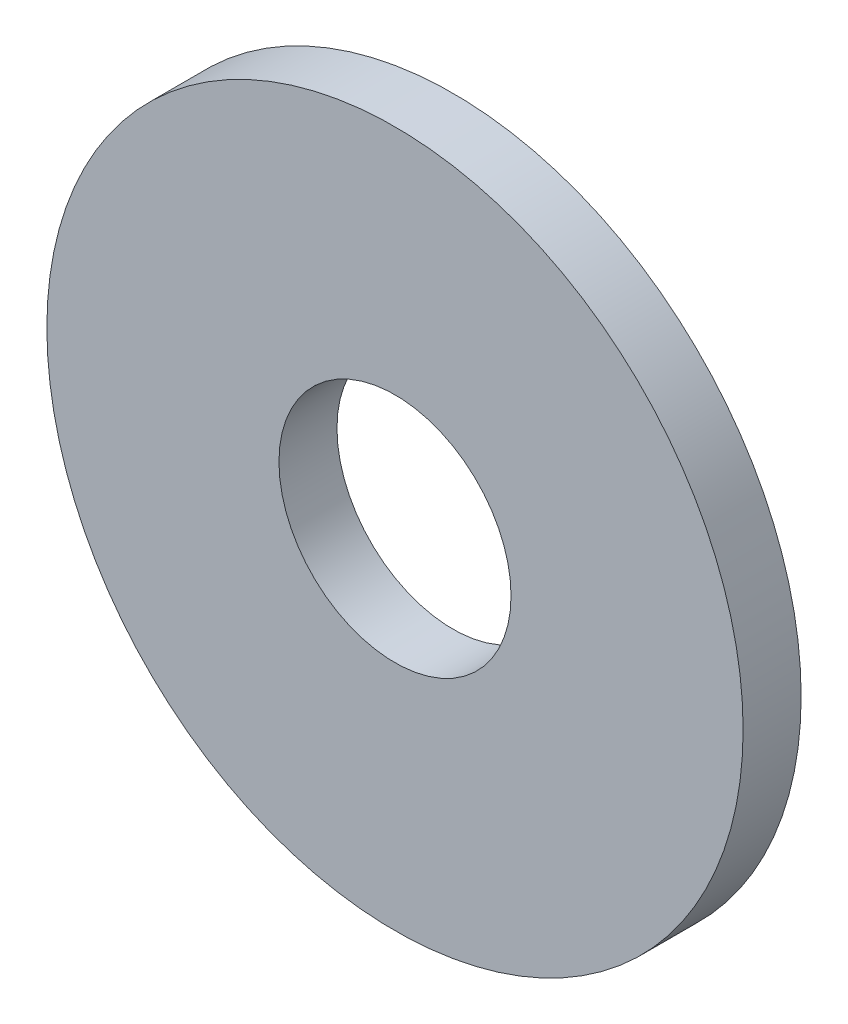
ISO-10303-21;
HEADER;
FILE_DESCRIPTION(('STEP AP214'),'2;1');
FILE_NAME('part.step','',(''),(''),'','','');
FILE_SCHEMA(('AUTOMOTIVE_DESIGN { 1 0 10303 214 1 1 1 1 }'));
ENDSEC;
DATA;
#1=APPLICATION_CONTEXT('core data for automotive mechanical design processes');
#2=APPLICATION_PROTOCOL_DEFINITION('international standard','automotive_design',2000,#1);
#3=PRODUCT_CONTEXT('',#1,'mechanical');
#4=PRODUCT('Part','Part','',(#3));
#5=PRODUCT_RELATED_PRODUCT_CATEGORY('part','',(#4));
#6=PRODUCT_DEFINITION_FORMATION('','',#4);
#7=PRODUCT_DEFINITION_CONTEXT('part definition',#1,'design');
#8=PRODUCT_DEFINITION('design','',#6,#7);
#9=PRODUCT_DEFINITION_SHAPE('','',#8);
#10=(LENGTH_UNIT() NAMED_UNIT(*) SI_UNIT(.MILLI.,.METRE.));
#11=(NAMED_UNIT(*) PLANE_ANGLE_UNIT() SI_UNIT($,.RADIAN.));
#12=(NAMED_UNIT(*) SI_UNIT($,.STERADIAN.) SOLID_ANGLE_UNIT());
#13=UNCERTAINTY_MEASURE_WITH_UNIT(LENGTH_MEASURE(1.E-05),#10,'distance_accuracy_value','');
#14=(GEOMETRIC_REPRESENTATION_CONTEXT(3) GLOBAL_UNCERTAINTY_ASSIGNED_CONTEXT((#13)) GLOBAL_UNIT_ASSIGNED_CONTEXT((#10,
#11,#12)) REPRESENTATION_CONTEXT('',''));
#15=CARTESIAN_POINT('',(0.,0.,0.));
#16=DIRECTION('',(0.,0.,1.));
#17=DIRECTION('',(1.,0.,0.));
#18=AXIS2_PLACEMENT_3D('',#15,#16,#17);
#19=CARTESIAN_POINT('',(0.,0.,1.));
#20=DIRECTION('',(0.,0.,1.));
#21=DIRECTION('',(1.,0.,0.));
#22=AXIS2_PLACEMENT_3D('',#19,#20,#21);
#23=PLANE('',#22);
#24=CARTESIAN_POINT('',(0.,0.,1.));
#25=DIRECTION('',(0.,0.,1.));
#26=DIRECTION('',(1.,0.,0.));
#27=AXIS2_PLACEMENT_3D('',#24,#25,#26);
#28=CIRCLE('',#27,6.);
#29=CARTESIAN_POINT('',(6.,0.,1.));
#30=VERTEX_POINT('',#29);
#31=EDGE_CURVE('E10',#30,#30,#28,.T.);
#32=ORIENTED_EDGE('',*,*,#31,.T.);
#33=EDGE_LOOP('',(#32));
#34=FACE_BOUND('',#33,.T.);
#35=CARTESIAN_POINT('',(0.,0.,1.));
#36=DIRECTION('',(0.,0.,1.));
#37=DIRECTION('',(1.,0.,0.));
#38=AXIS2_PLACEMENT_3D('',#35,#36,#37);
#39=CIRCLE('',#38,2.);
#40=CARTESIAN_POINT('',(2.,0.,1.));
#41=VERTEX_POINT('',#40);
#42=EDGE_CURVE('E46',#41,#41,#39,.T.);
#43=ORIENTED_EDGE('',*,*,#42,.F.);
#44=EDGE_LOOP('',(#43));
#45=FACE_BOUND('',#44,.T.);
#46=ADVANCED_FACE('F35',(#34,#45),#23,.T.);
#47=CARTESIAN_POINT('',(0.,0.,0.));
#48=DIRECTION('',(0.,0.,1.));
#49=DIRECTION('',(1.,0.,0.));
#50=AXIS2_PLACEMENT_3D('',#47,#48,#49);
#51=PLANE('',#50);
#52=CARTESIAN_POINT('',(0.,0.,0.));
#53=DIRECTION('',(0.,0.,1.));
#54=DIRECTION('',(1.,0.,0.));
#55=AXIS2_PLACEMENT_3D('',#52,#53,#54);
#56=CIRCLE('',#55,6.);
#57=CARTESIAN_POINT('',(6.,0.,0.));
#58=VERTEX_POINT('',#57);
#59=EDGE_CURVE('E39',#58,#58,#56,.T.);
#60=ORIENTED_EDGE('',*,*,#59,.F.);
#61=EDGE_LOOP('',(#60));
#62=FACE_BOUND('',#61,.T.);
#63=CARTESIAN_POINT('',(0.,0.,0.));
#64=DIRECTION('',(0.,0.,1.));
#65=DIRECTION('',(1.,0.,0.));
#66=AXIS2_PLACEMENT_3D('',#63,#64,#65);
#67=CIRCLE('',#66,2.);
#68=CARTESIAN_POINT('',(2.,0.,0.));
#69=VERTEX_POINT('',#68);
#70=EDGE_CURVE('E48',#69,#69,#67,.T.);
#71=ORIENTED_EDGE('',*,*,#70,.T.);
#72=EDGE_LOOP('',(#71));
#73=FACE_BOUND('',#72,.T.);
#74=ADVANCED_FACE('F58',(#62,#73),#51,.F.);
#75=CARTESIAN_POINT('',(0.,0.,1.));
#76=DIRECTION('',(0.,0.,-1.));
#77=DIRECTION('',(-1.,0.,0.));
#78=AXIS2_PLACEMENT_3D('',#75,#76,#77);
#79=CYLINDRICAL_SURFACE('',#78,6.);
#80=ORIENTED_EDGE('',*,*,#31,.F.);
#81=EDGE_LOOP('',(#80));
#82=FACE_BOUND('',#81,.T.);
#83=ORIENTED_EDGE('',*,*,#59,.T.);
#84=EDGE_LOOP('',(#83));
#85=FACE_BOUND('',#84,.T.);
#86=ADVANCED_FACE('F37',(#82,#85),#79,.T.);
#87=CARTESIAN_POINT('',(0.,0.,1.));
#88=DIRECTION('',(0.,0.,-1.));
#89=DIRECTION('',(-1.,0.,0.));
#90=AXIS2_PLACEMENT_3D('',#87,#88,#89);
#91=CYLINDRICAL_SURFACE('',#90,2.);
#92=ORIENTED_EDGE('',*,*,#42,.T.);
#93=EDGE_LOOP('',(#92));
#94=FACE_BOUND('',#93,.T.);
#95=ORIENTED_EDGE('',*,*,#70,.F.);
#96=EDGE_LOOP('',(#95));
#97=FACE_BOUND('',#96,.T.);
#98=ADVANCED_FACE('F54',(#94,#97),#91,.F.);
#99=CLOSED_SHELL('',(#46,#74,#86,#98));
#100=MANIFOLD_SOLID_BREP('B2',#99);
#101=ADVANCED_BREP_SHAPE_REPRESENTATION('',(#18,#100),#14);
#102=SHAPE_DEFINITION_REPRESENTATION(#9,#101);
ENDSEC;
END-ISO-10303-21;
